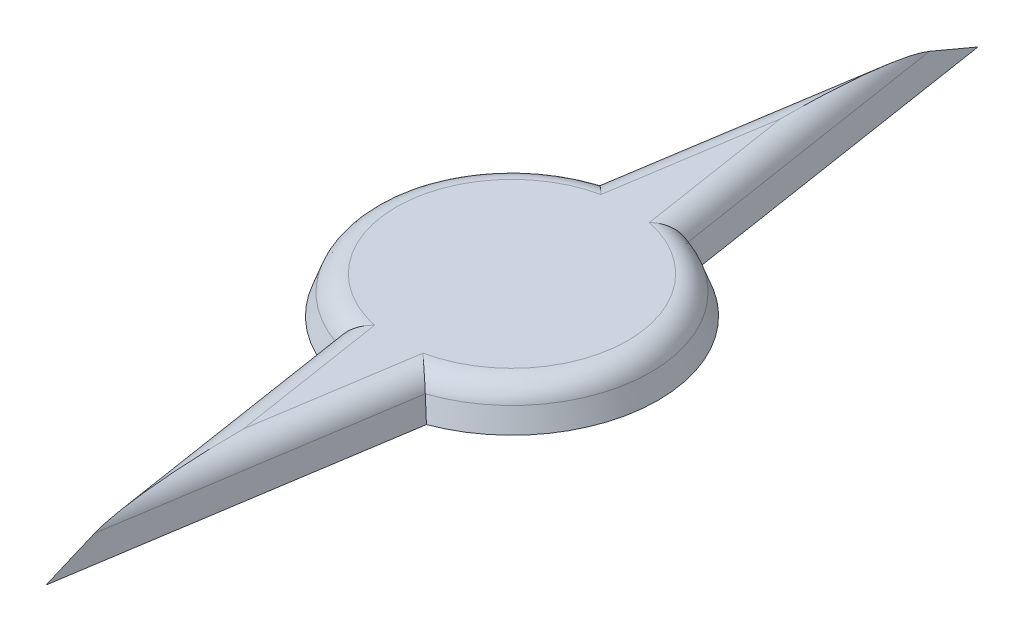
ISO-10303-21;
HEADER;
FILE_DESCRIPTION(('STEP AP214'),'2;1');
FILE_NAME('part.step','',(''),(''),'','','');
FILE_SCHEMA(('AUTOMOTIVE_DESIGN { 1 0 10303 214 1 1 1 1 }'));
ENDSEC;
DATA;
#1=APPLICATION_CONTEXT('core data for automotive mechanical design processes');
#2=APPLICATION_PROTOCOL_DEFINITION('international standard','automotive_design',2000,#1);
#3=PRODUCT_CONTEXT('',#1,'mechanical');
#4=PRODUCT('Part','Part','',(#3));
#5=PRODUCT_RELATED_PRODUCT_CATEGORY('part','',(#4));
#6=PRODUCT_DEFINITION_FORMATION('','',#4);
#7=PRODUCT_DEFINITION_CONTEXT('part definition',#1,'design');
#8=PRODUCT_DEFINITION('design','',#6,#7);
#9=PRODUCT_DEFINITION_SHAPE('','',#8);
#10=(LENGTH_UNIT() NAMED_UNIT(*) SI_UNIT(.MILLI.,.METRE.));
#11=(NAMED_UNIT(*) PLANE_ANGLE_UNIT() SI_UNIT($,.RADIAN.));
#12=(NAMED_UNIT(*) SI_UNIT($,.STERADIAN.) SOLID_ANGLE_UNIT());
#13=UNCERTAINTY_MEASURE_WITH_UNIT(LENGTH_MEASURE(1.E-05),#10,'distance_accuracy_value','');
#14=(GEOMETRIC_REPRESENTATION_CONTEXT(3) GLOBAL_UNCERTAINTY_ASSIGNED_CONTEXT((#13)) GLOBAL_UNIT_ASSIGNED_CONTEXT((#10,
#11,#12)) REPRESENTATION_CONTEXT('',''));
#15=CARTESIAN_POINT('',(0.,0.,0.));
#16=DIRECTION('',(0.,0.,1.));
#17=DIRECTION('',(1.,0.,0.));
#18=AXIS2_PLACEMENT_3D('',#15,#16,#17);
#19=CARTESIAN_POINT('',(2.90936113715403,0.,0.453006211539587));
#20=DIRECTION('',(0.928504468915029,0.342020143325669,0.14457410820859));
#21=DIRECTION('',(-0.345651567214323,0.938362933028731,0.));
#22=AXIS2_PLACEMENT_3D('',#19,#20,#21);
#23=PLANE('',#22);
#24=CARTESIAN_POINT('',(1.61628006099897,1.5,5.20905382899304));
#25=CARTESIAN_POINT('',(1.6568122500095,1.37517262260805,5.24404736233082));
#26=CARTESIAN_POINT('',(1.69739744021863,1.25029826987364,5.27881163375714));
#27=CARTESIAN_POINT('',(1.77866819175476,1.0004624570002,5.34790162958865));
#28=CARTESIAN_POINT('',(1.81935375203628,0.87550099777815,5.38222735853901));
#29=CARTESIAN_POINT('',(1.90082040335216,0.625495379312143,5.45046092932056));
#30=CARTESIAN_POINT('',(1.94160149426883,0.500451220170212,5.48436877166627));
#31=CARTESIAN_POINT('',(2.02325507800371,0.250283575520157,5.5517851050517));
#32=CARTESIAN_POINT('',(2.06412757176555,0.125160089202723,5.58529359194577));
#33=CARTESIAN_POINT('',(2.10504325451616,0.,5.61861129609611));
#34=B_SPLINE_CURVE_WITH_KNOTS('',3,(#24,#25,#26,#27,#28,#29,#30,#31,#32,#33),.UNSPECIFIED.,.F.,
.F.,(4,2,2,2,4),(0.,0.407484053916502,0.814963881129874,1.22244320659282,1.62992675837409),.UNSPECIFIED.);
#35=CARTESIAN_POINT('',(1.83026995534138,0.842020143325068,5.39132568951018));
#36=VERTEX_POINT('',#35);
#37=CARTESIAN_POINT('',(2.10504325451622,0.,5.61861129609584));
#38=VERTEX_POINT('',#37);
#39=EDGE_CURVE('E110',#36,#38,#34,.T.);
#40=ORIENTED_EDGE('',*,*,#39,.F.);
#41=DIRECTION('',(0.153852552431109,0.,-0.988093817463925));
#42=VECTOR('',#41,1.);
#43=CARTESIAN_POINT('',(0.23663372946838,0.84202014332567,15.6262036761886));
#44=LINE('',#43,#42);
#45=CARTESIAN_POINT('',(0.,0.842020143325668,17.1459465819544));
#46=VERTEX_POINT('',#45);
#47=EDGE_CURVE('E11',#36,#46,#44,.F.);
#48=ORIENTED_EDGE('',*,*,#47,.T.);
#49=DIRECTION('',(0.,0.389350510993613,-0.921089669678807));
#50=VECTOR('',#49,1.);
#51=CARTESIAN_POINT('',(0.,6.70090977149599,3.28552374977649));
#52=LINE('',#51,#50);
#53=CARTESIAN_POINT('',(0.,0.,19.1379204815121));
#54=VERTEX_POINT('',#53);
#55=EDGE_CURVE('E133',#46,#54,#52,.F.);
#56=ORIENTED_EDGE('',*,*,#55,.T.);
#57=DIRECTION('',(0.153852552431109,0.,-0.988093817463925));
#58=VECTOR('',#57,1.);
#59=CARTESIAN_POINT('',(2.90936113715403,0.,0.453006211539587));
#60=LINE('',#59,#58);
#61=EDGE_CURVE('E125',#54,#38,#60,.T.);
#62=ORIENTED_EDGE('',*,*,#61,.T.);
#63=EDGE_LOOP('',(#40,#48,#56,#62));
#64=FACE_BOUND('',#63,.T.);
#65=ADVANCED_FACE('F35',(#64),#23,.T.);
#66=CARTESIAN_POINT('',(0.,0.,0.));
#67=DIRECTION('',(0.,-1.,0.));
#68=DIRECTION('',(0.,0.,1.));
#69=AXIS2_PLACEMENT_3D('',#66,#67,#68);
#70=CONICAL_SURFACE('',#69,6.,0.349065850398867);
#71=CARTESIAN_POINT('',(1.61628006099897,1.5,-5.20905382899304));
#72=CARTESIAN_POINT('',(1.6568122500095,1.37517262260805,-5.24404736233082));
#73=CARTESIAN_POINT('',(1.69739744021863,1.25029826987364,-5.27881163375714));
#74=CARTESIAN_POINT('',(1.77866819175476,1.0004624570002,-5.34790162958865));
#75=CARTESIAN_POINT('',(1.81935375203628,0.87550099777815,-5.38222735853901));
#76=CARTESIAN_POINT('',(1.90082040335216,0.625495379312143,-5.45046092932056));
#77=CARTESIAN_POINT('',(1.94160149426883,0.500451220170212,-5.48436877166627));
#78=CARTESIAN_POINT('',(2.02325507800371,0.250283575520157,-5.5517851050517));
#79=CARTESIAN_POINT('',(2.06412757176555,0.125160089202723,-5.58529359194577));
#80=CARTESIAN_POINT('',(2.10504325451616,0.,-5.61861129609611));
#81=B_SPLINE_CURVE_WITH_KNOTS('',3,(#71,#72,#73,#74,#75,#76,#77,#78,#79,#80),.UNSPECIFIED.,.F.,
.F.,(4,2,2,2,4),(0.,0.407484053916502,0.814963881129874,1.22244320659282,1.62992675837409),.UNSPECIFIED.);
#82=CARTESIAN_POINT('',(1.83026995534138,0.842020143325065,-5.39132568951018));
#83=VERTEX_POINT('',#82);
#84=CARTESIAN_POINT('',(2.10504325451622,0.,-5.61861129609584));
#85=VERTEX_POINT('',#84);
#86=EDGE_CURVE('E119',#83,#85,#81,.T.);
#87=ORIENTED_EDGE('',*,*,#86,.F.);
#88=CARTESIAN_POINT('',(0.,0.842020143325669,0.));
#89=DIRECTION('',(0.,-1.,0.));
#90=DIRECTION('',(0.,0.,-1.));
#91=AXIS2_PLACEMENT_3D('',#88,#89,#90);
#92=CIRCLE('',#91,5.69352973117689);
#93=EDGE_CURVE('E49',#83,#36,#92,.T.);
#94=ORIENTED_EDGE('',*,*,#93,.T.);
#95=ORIENTED_EDGE('',*,*,#39,.T.);
#96=CARTESIAN_POINT('',(0.,0.,0.));
#97=DIRECTION('',(0.,1.,0.));
#98=DIRECTION('',(0.,0.,1.));
#99=AXIS2_PLACEMENT_3D('',#96,#97,#98);
#100=CIRCLE('',#99,6.);
#101=EDGE_CURVE('E113',#38,#85,#100,.T.);
#102=ORIENTED_EDGE('',*,*,#101,.T.);
#103=EDGE_LOOP('',(#87,#94,#95,#102));
#104=FACE_BOUND('',#103,.T.);
#105=ADVANCED_FACE('F112',(#104),#70,.T.);
#106=CARTESIAN_POINT('',(2.90936113715403,0.,-0.453006211539587));
#107=DIRECTION('',(0.928504468915029,0.342020143325669,-0.14457410820859));
#108=DIRECTION('',(-0.345651567214323,0.938362933028731,0.));
#109=AXIS2_PLACEMENT_3D('',#106,#107,#108);
#110=PLANE('',#109);
#111=DIRECTION('',(0.,0.389350510993613,0.921089669678807));
#112=VECTOR('',#111,1.);
#113=CARTESIAN_POINT('',(0.,6.70090977149599,-3.28552374977649));
#114=LINE('',#113,#112);
#115=CARTESIAN_POINT('',(0.,0.842020143325668,-17.1459465819544));
#116=VERTEX_POINT('',#115);
#117=CARTESIAN_POINT('',(0.,0.,-19.1379204815121));
#118=VERTEX_POINT('',#117);
#119=EDGE_CURVE('E167',#116,#118,#114,.F.);
#120=ORIENTED_EDGE('',*,*,#119,.F.);
#121=DIRECTION('',(0.153852552431109,0.,0.988093817463925));
#122=VECTOR('',#121,1.);
#123=CARTESIAN_POINT('',(2.60653975929341,0.84202014332567,-0.405854978436904));
#124=LINE('',#123,#122);
#125=EDGE_CURVE('E64',#116,#83,#124,.T.);
#126=ORIENTED_EDGE('',*,*,#125,.T.);
#127=ORIENTED_EDGE('',*,*,#86,.T.);
#128=DIRECTION('',(0.153852552431109,0.,0.988093817463925));
#129=VECTOR('',#128,1.);
#130=CARTESIAN_POINT('',(2.90936113715403,0.,-0.453006211539587));
#131=LINE('',#130,#129);
#132=EDGE_CURVE('E129',#118,#85,#131,.T.);
#133=ORIENTED_EDGE('',*,*,#132,.F.);
#134=EDGE_LOOP('',(#120,#126,#127,#133));
#135=FACE_BOUND('',#134,.T.);
#136=ADVANCED_FACE('F155',(#135),#110,.T.);
#137=CARTESIAN_POINT('',(-2.90936113715403,0.,-0.453006211539587));
#138=DIRECTION('',(-0.928504468915029,0.342020143325669,-0.14457410820859));
#139=DIRECTION('',(-0.345651567214323,-0.938362933028731,0.));
#140=AXIS2_PLACEMENT_3D('',#137,#138,#139);
#141=PLANE('',#140);
#142=CARTESIAN_POINT('',(-1.61628006099897,1.5,-5.20905382899304));
#143=CARTESIAN_POINT('',(-1.6568122500095,1.37517262260805,-5.24404736233082));
#144=CARTESIAN_POINT('',(-1.69739744021863,1.25029826987364,-5.27881163375714));
#145=CARTESIAN_POINT('',(-1.77866819175476,1.0004624570002,-5.34790162958865));
#146=CARTESIAN_POINT('',(-1.81935375203628,0.87550099777815,-5.38222735853901));
#147=CARTESIAN_POINT('',(-1.90082040335216,0.625495379312143,-5.45046092932056));
#148=CARTESIAN_POINT('',(-1.94160149426883,0.500451220170212,-5.48436877166627));
#149=CARTESIAN_POINT('',(-2.02325507800371,0.250283575520157,-5.5517851050517));
#150=CARTESIAN_POINT('',(-2.06412757176555,0.125160089202723,-5.58529359194577));
#151=CARTESIAN_POINT('',(-2.10504325451616,0.,-5.61861129609611));
#152=B_SPLINE_CURVE_WITH_KNOTS('',3,(#142,#143,#144,#145,#146,#147,#148,#149,#150,#151),
.UNSPECIFIED.,.F.,.F.,(4,2,2,2,4),(0.,0.407484053916502,0.814963881129874,1.22244320659282,
1.62992675837409),.UNSPECIFIED.);
#153=CARTESIAN_POINT('',(-1.83026995534138,0.842020143325068,-5.39132568951018));
#154=VERTEX_POINT('',#153);
#155=CARTESIAN_POINT('',(-2.10504325451622,0.,-5.61861129609584));
#156=VERTEX_POINT('',#155);
#157=EDGE_CURVE('E355',#154,#156,#152,.T.);
#158=ORIENTED_EDGE('',*,*,#157,.F.);
#159=DIRECTION('',(-0.153852552431109,0.,0.988093817463925));
#160=VECTOR('',#159,1.);
#161=CARTESIAN_POINT('',(-0.23663372946838,0.84202014332567,-15.6262036761886));
#162=LINE('',#161,#160);
#163=EDGE_CURVE('E352',#154,#116,#162,.F.);
#164=ORIENTED_EDGE('',*,*,#163,.T.);
#165=ORIENTED_EDGE('',*,*,#119,.T.);
#166=DIRECTION('',(-0.153852552431109,0.,0.988093817463925));
#167=VECTOR('',#166,1.);
#168=CARTESIAN_POINT('',(-2.90936113715403,0.,-0.453006211539587));
#169=LINE('',#168,#167);
#170=EDGE_CURVE('E139',#118,#156,#169,.T.);
#171=ORIENTED_EDGE('',*,*,#170,.T.);
#172=EDGE_LOOP('',(#158,#164,#165,#171));
#173=FACE_BOUND('',#172,.T.);
#174=ADVANCED_FACE('F174',(#173),#141,.T.);
#175=CARTESIAN_POINT('',(0.,0.,0.));
#176=DIRECTION('',(0.,-1.,0.));
#177=DIRECTION('',(0.,0.,1.));
#178=AXIS2_PLACEMENT_3D('',#175,#176,#177);
#179=CONICAL_SURFACE('',#178,6.,0.349065850398867);
#180=CARTESIAN_POINT('',(-1.61628006099897,1.5,5.20905382899304));
#181=CARTESIAN_POINT('',(-1.6568122500095,1.37517262260805,5.24404736233082));
#182=CARTESIAN_POINT('',(-1.69739744021863,1.25029826987364,5.27881163375714));
#183=CARTESIAN_POINT('',(-1.77866819175476,1.0004624570002,5.34790162958865));
#184=CARTESIAN_POINT('',(-1.81935375203628,0.87550099777815,5.38222735853901));
#185=CARTESIAN_POINT('',(-1.90082040335216,0.625495379312143,5.45046092932056));
#186=CARTESIAN_POINT('',(-1.94160149426883,0.500451220170212,5.48436877166627));
#187=CARTESIAN_POINT('',(-2.02325507800371,0.250283575520157,5.5517851050517));
#188=CARTESIAN_POINT('',(-2.06412757176555,0.125160089202723,5.58529359194577));
#189=CARTESIAN_POINT('',(-2.10504325451616,0.,5.61861129609611));
#190=B_SPLINE_CURVE_WITH_KNOTS('',3,(#180,#181,#182,#183,#184,#185,#186,#187,#188,#189),
.UNSPECIFIED.,.F.,.F.,(4,2,2,2,4),(0.,0.407484053916502,0.814963881129874,1.22244320659282,
1.62992675837409),.UNSPECIFIED.);
#191=CARTESIAN_POINT('',(-1.83026995534138,0.842020143325065,5.39132568951018));
#192=VERTEX_POINT('',#191);
#193=CARTESIAN_POINT('',(-2.10504325451622,0.,5.61861129609584));
#194=VERTEX_POINT('',#193);
#195=EDGE_CURVE('E356',#192,#194,#190,.T.);
#196=ORIENTED_EDGE('',*,*,#195,.F.);
#197=CARTESIAN_POINT('',(0.,0.842020143325669,0.));
#198=DIRECTION('',(0.,-1.,0.));
#199=DIRECTION('',(0.,0.,-1.));
#200=AXIS2_PLACEMENT_3D('',#197,#198,#199);
#201=CIRCLE('',#200,5.69352973117689);
#202=EDGE_CURVE('E350',#192,#154,#201,.T.);
#203=ORIENTED_EDGE('',*,*,#202,.T.);
#204=ORIENTED_EDGE('',*,*,#157,.T.);
#205=EDGE_CURVE('E131',#156,#194,#100,.T.);
#206=ORIENTED_EDGE('',*,*,#205,.T.);
#207=EDGE_LOOP('',(#196,#203,#204,#206));
#208=FACE_BOUND('',#207,.T.);
#209=ADVANCED_FACE('F239',(#208),#179,.T.);
#210=CARTESIAN_POINT('',(-2.90936113715403,0.,0.453006211539587));
#211=DIRECTION('',(-0.928504468915029,0.342020143325669,0.14457410820859));
#212=DIRECTION('',(-0.345651567214323,-0.938362933028731,0.));
#213=AXIS2_PLACEMENT_3D('',#210,#211,#212);
#214=PLANE('',#213);
#215=ORIENTED_EDGE('',*,*,#55,.F.);
#216=DIRECTION('',(-0.153852552431109,0.,-0.988093817463925));
#217=VECTOR('',#216,1.);
#218=CARTESIAN_POINT('',(-2.60653975929341,0.84202014332567,0.405854978436904));
#219=LINE('',#218,#217);
#220=EDGE_CURVE('E118',#46,#192,#219,.T.);
#221=ORIENTED_EDGE('',*,*,#220,.T.);
#222=ORIENTED_EDGE('',*,*,#195,.T.);
#223=DIRECTION('',(-0.153852552431109,0.,-0.988093817463925));
#224=VECTOR('',#223,1.);
#225=CARTESIAN_POINT('',(-2.90936113715403,0.,0.453006211539587));
#226=LINE('',#225,#224);
#227=EDGE_CURVE('E142',#54,#194,#226,.T.);
#228=ORIENTED_EDGE('',*,*,#227,.F.);
#229=EDGE_LOOP('',(#215,#221,#222,#228));
#230=FACE_BOUND('',#229,.T.);
#231=ADVANCED_FACE('F156',(#230),#214,.T.);
#232=CARTESIAN_POINT('',(0.,1.5,0.));
#233=DIRECTION('',(0.,1.,0.));
#234=DIRECTION('',(0.,0.,1.));
#235=AXIS2_PLACEMENT_3D('',#232,#233,#234);
#236=PLANE('',#235);
#237=CARTESIAN_POINT('',(0.,1.5,0.));
#238=DIRECTION('',(0.,1.,0.));
#239=DIRECTION('',(0.,0.,1.));
#240=AXIS2_PLACEMENT_3D('',#237,#238,#239);
#241=CIRCLE('',#240,4.75383711039099);
#242=CARTESIAN_POINT('',(-0.994907483990374,1.5,-4.64856175288986));
#243=VERTEX_POINT('',#242);
#244=CARTESIAN_POINT('',(-0.994907483990373,1.5,4.64856175288986));
#245=VERTEX_POINT('',#244);
#246=EDGE_CURVE('E340',#243,#245,#241,.T.);
#247=ORIENTED_EDGE('',*,*,#246,.T.);
#248=DIRECTION('',(-0.153852552431109,0.,-0.988093817463925));
#249=VECTOR('',#248,1.);
#250=CARTESIAN_POINT('',(-1.67803529037839,1.5,0.261280870228314));
#251=LINE('',#250,#249);
#252=CARTESIAN_POINT('',(0.,1.5,11.0381985729853));
#253=VERTEX_POINT('',#252);
#254=EDGE_CURVE('E342',#245,#253,#251,.F.);
#255=ORIENTED_EDGE('',*,*,#254,.T.);
#256=DIRECTION('',(-0.153852552431109,0.,0.988093817463925));
#257=VECTOR('',#256,1.);
#258=CARTESIAN_POINT('',(0.924409321552325,1.5,5.10132511200797));
#259=LINE('',#258,#257);
#260=CARTESIAN_POINT('',(0.994907483990374,1.5,4.64856175288986));
#261=VERTEX_POINT('',#260);
#262=EDGE_CURVE('E376',#253,#261,#259,.F.);
#263=ORIENTED_EDGE('',*,*,#262,.T.);
#264=CARTESIAN_POINT('',(0.,1.5,0.));
#265=DIRECTION('',(0.,1.,0.));
#266=DIRECTION('',(0.,0.,1.));
#267=AXIS2_PLACEMENT_3D('',#264,#265,#266);
#268=CIRCLE('',#267,4.75383711039099);
#269=CARTESIAN_POINT('',(0.994907483990373,1.5,-4.64856175288986));
#270=VERTEX_POINT('',#269);
#271=EDGE_CURVE('E344',#261,#270,#268,.T.);
#272=ORIENTED_EDGE('',*,*,#271,.T.);
#273=DIRECTION('',(0.153852552431109,0.,0.988093817463925));
#274=VECTOR('',#273,1.);
#275=CARTESIAN_POINT('',(1.67803529037839,1.5,-0.261280870228314));
#276=LINE('',#275,#274);
#277=CARTESIAN_POINT('',(0.,1.5,-11.0381985729853));
#278=VERTEX_POINT('',#277);
#279=EDGE_CURVE('E335',#270,#278,#276,.F.);
#280=ORIENTED_EDGE('',*,*,#279,.T.);
#281=DIRECTION('',(0.153852552431109,0.,-0.988093817463925));
#282=VECTOR('',#281,1.);
#283=CARTESIAN_POINT('',(-0.924409321552325,1.5,-5.10132511200797));
#284=LINE('',#283,#282);
#285=EDGE_CURVE('E338',#278,#243,#284,.F.);
#286=ORIENTED_EDGE('',*,*,#285,.T.);
#287=EDGE_LOOP('',(#247,#255,#263,#272,#280,#286));
#288=FACE_BOUND('',#287,.T.);
#289=ADVANCED_FACE('F252',(#288),#236,.T.);
#290=CARTESIAN_POINT('',(0.,0.,0.));
#291=DIRECTION('',(0.,1.,0.));
#292=DIRECTION('',(0.,0.,1.));
#293=AXIS2_PLACEMENT_3D('',#290,#291,#292);
#294=PLANE('',#293);
#295=ORIENTED_EDGE('',*,*,#61,.F.);
#296=ORIENTED_EDGE('',*,*,#227,.T.);
#297=ORIENTED_EDGE('',*,*,#205,.F.);
#298=ORIENTED_EDGE('',*,*,#170,.F.);
#299=ORIENTED_EDGE('',*,*,#132,.T.);
#300=ORIENTED_EDGE('',*,*,#101,.F.);
#301=EDGE_LOOP('',(#295,#296,#297,#298,#299,#300));
#302=FACE_BOUND('',#301,.T.);
#303=ADVANCED_FACE('F123',(#302),#294,.F.);
#304=CARTESIAN_POINT('',(1.67803529037838,0.5,-0.261280870228314));
#305=DIRECTION('',(0.153852552431109,0.,0.988093817463925));
#306=DIRECTION('',(0.988093817463925,0.,-0.153852552431109));
#307=AXIS2_PLACEMENT_3D('',#304,#305,#306);
#308=CYLINDRICAL_SURFACE('',#307,1.);
#309=CARTESIAN_POINT('',(0.,0.5,-11.0381985729853));
#310=DIRECTION('',(1.,0.,0.));
#311=DIRECTION('',(0.,0.,1.));
#312=AXIS2_PLACEMENT_3D('',#309,#310,#311);
#313=ELLIPSE('',#312,6.49972967102887,1.);
#314=EDGE_CURVE('E136',#278,#116,#313,.F.);
#315=ORIENTED_EDGE('',*,*,#314,.F.);
#316=ORIENTED_EDGE('',*,*,#279,.F.);
#317=CARTESIAN_POINT('',(1.8302699553424,0.84202014332567,-5.39132568951153));
#318=CARTESIAN_POINT('',(1.82178981353742,0.868059089311883,-5.38419726372572));
#319=CARTESIAN_POINT('',(1.81238638421831,0.893559840203512,-5.37628237909534));
#320=CARTESIAN_POINT('',(1.7918756416508,0.943324370294564,-5.35898293396907));
#321=CARTESIAN_POINT('',(1.78076966774971,0.967589102019278,-5.34959952859988));
#322=CARTESIAN_POINT('',(1.74524830764782,1.03803365233617,-5.31951703617427));
#323=CARTESIAN_POINT('',(1.71851252752537,1.08221506298783,-5.29678780059815));
#324=CARTESIAN_POINT('',(1.66021001289462,1.16413957633613,-5.2469199172914));
#325=CARTESIAN_POINT('',(1.62865732549502,1.20190074596514,-5.21979407722628));
#326=CARTESIAN_POINT('',(1.56178392545022,1.27080503328503,-5.16190004124216));
#327=CARTESIAN_POINT('',(1.52645739053703,1.30193769648755,-5.13112620896427));
#328=CARTESIAN_POINT('',(1.44904624431465,1.36044681598081,-5.06316282748129));
#329=CARTESIAN_POINT('',(1.40664730777196,1.38701729180475,-5.02564051859422));
#330=CARTESIAN_POINT('',(1.31980977865453,1.43172870090486,-4.94805171821582));
#331=CARTESIAN_POINT('',(1.27537090118049,1.44986845278176,-4.90798487105136));
#332=CARTESIAN_POINT('',(1.19230364677369,1.47576897634037,-4.8323171338724));
#333=CARTESIAN_POINT('',(1.15380900268529,1.48468199261312,-4.79695330895735));
#334=CARTESIAN_POINT('',(1.07669906596949,1.49666843758397,-4.72546416433867));
#335=CARTESIAN_POINT('',(1.03808404034852,1.49975059134193,-4.68934006431663));
#336=CARTESIAN_POINT('',(0.99807839663748,1.49999516031506,-4.65155817007983));
#337=CARTESIAN_POINT('',(0.996492763874704,1.50000000401357,-4.65006008913247));
#338=CARTESIAN_POINT('',(0.994907483990374,1.5,-4.64856175288986));
#339=B_SPLINE_CURVE_WITH_KNOTS('',3,(#317,#318,#319,#320,#321,#322,#323,#324,#325,#326,#327,
#328,#329,#330,#331,#332,#333,#334,#335,#336,#337,#338),.UNSPECIFIED.,.F.,.F.,(4,2,2,2,2,2,2,2,
2,2,4),(0.,0.0848254181780801,0.169584445641453,0.337970120457949,0.505873810494479,
0.674040388237911,0.860959336635322,1.04790447013604,1.20667335861085,1.36520448343832,
1.37174865376917),.UNSPECIFIED.);
#340=EDGE_CURVE('E40',#83,#270,#339,.T.);
#341=ORIENTED_EDGE('',*,*,#340,.F.);
#342=ORIENTED_EDGE('',*,*,#125,.F.);
#343=EDGE_LOOP('',(#315,#316,#341,#342));
#344=FACE_BOUND('',#343,.T.);
#345=ADVANCED_FACE('F37',(#344),#308,.T.);
#346=CARTESIAN_POINT('',(0.,0.5,0.));
#347=DIRECTION('',(0.,1.,0.));
#348=DIRECTION('',(0.,0.,1.));
#349=AXIS2_PLACEMENT_3D('',#346,#347,#348);
#350=TOROIDAL_SURFACE('',#349,4.75383711039099,1.);
#351=ORIENTED_EDGE('',*,*,#340,.T.);
#352=ORIENTED_EDGE('',*,*,#271,.F.);
#353=CARTESIAN_POINT('',(1.83026995534289,0.84202014332567,5.39132568951095));
#354=CARTESIAN_POINT('',(1.8217898135376,0.868059089311882,5.3841972637255));
#355=CARTESIAN_POINT('',(1.81238638421836,0.89355984020351,5.37628237909529));
#356=CARTESIAN_POINT('',(1.79187564165076,0.943324370294559,5.35898293396913));
#357=CARTESIAN_POINT('',(1.7807696677497,0.967589102019272,5.3495995285999));
#358=CARTESIAN_POINT('',(1.74524830764786,1.03803365233616,5.31951703617423));
#359=CARTESIAN_POINT('',(1.71851252752539,1.08221506298782,5.29678780059815));
#360=CARTESIAN_POINT('',(1.66021001289463,1.16413957633611,5.24691991729142));
#361=CARTESIAN_POINT('',(1.62865732549503,1.20190074596513,5.2197940772263));
#362=CARTESIAN_POINT('',(1.56178392545024,1.27080503328502,5.16190004124217));
#363=CARTESIAN_POINT('',(1.52645739053705,1.30193769648754,5.13112620896429));
#364=CARTESIAN_POINT('',(1.44904624431468,1.36044681598079,5.06316282748131));
#365=CARTESIAN_POINT('',(1.40664730777199,1.38701729180473,5.02564051859424));
#366=CARTESIAN_POINT('',(1.31980977865455,1.43172870090484,4.94805171821584));
#367=CARTESIAN_POINT('',(1.27537090118052,1.44986845278175,4.90798487105139));
#368=CARTESIAN_POINT('',(1.19230364677371,1.47576897634036,4.83231713387242));
#369=CARTESIAN_POINT('',(1.15380900268531,1.48468199261311,4.79695330895737));
#370=CARTESIAN_POINT('',(1.0766990659695,1.49666843758397,4.72546416433868));
#371=CARTESIAN_POINT('',(1.03808404034852,1.49975059134194,4.68934006431663));
#372=CARTESIAN_POINT('',(0.998078396637479,1.49999516031506,4.65155817007983));
#373=CARTESIAN_POINT('',(0.996492763874704,1.50000000401357,4.65006008913247));
#374=CARTESIAN_POINT('',(0.994907483990374,1.5,4.64856175288986));
#375=B_SPLINE_CURVE_WITH_KNOTS('',3,(#353,#354,#355,#356,#357,#358,#359,#360,#361,#362,#363,
#364,#365,#366,#367,#368,#369,#370,#371,#372,#373,#374),.UNSPECIFIED.,.F.,.F.,(4,2,2,2,2,2,2,2,
2,2,4),(0.,0.0848254181780758,0.169584445641444,0.33797012045793,0.505873810494454,
0.674040388237876,0.860959336635284,1.047904470136,1.20667335861083,1.36520448343832,
1.37174865376917),.UNSPECIFIED.);
#376=EDGE_CURVE('E199',#36,#261,#375,.T.);
#377=ORIENTED_EDGE('',*,*,#376,.F.);
#378=ORIENTED_EDGE('',*,*,#93,.F.);
#379=EDGE_LOOP('',(#351,#352,#377,#378));
#380=FACE_BOUND('',#379,.T.);
#381=ADVANCED_FACE('F207',(#380),#350,.T.);
#382=CARTESIAN_POINT('',(-1.67803529037838,0.5,-0.261280870228314));
#383=DIRECTION('',(-0.153852552431109,0.,0.988093817463925));
#384=DIRECTION('',(0.988093817463925,0.,0.153852552431109));
#385=AXIS2_PLACEMENT_3D('',#382,#383,#384);
#386=CYLINDRICAL_SURFACE('',#385,1.);
#387=ORIENTED_EDGE('',*,*,#314,.T.);
#388=ORIENTED_EDGE('',*,*,#163,.F.);
#389=CARTESIAN_POINT('',(-1.83026995534289,0.84202014332567,-5.39132568951095));
#390=CARTESIAN_POINT('',(-1.8217898135376,0.868059089311882,-5.3841972637255));
#391=CARTESIAN_POINT('',(-1.81238638421836,0.89355984020351,-5.37628237909529));
#392=CARTESIAN_POINT('',(-1.79187564165076,0.94332437029456,-5.35898293396913));
#393=CARTESIAN_POINT('',(-1.7807696677497,0.967589102019272,-5.3495995285999));
#394=CARTESIAN_POINT('',(-1.74524830764786,1.03803365233616,-5.31951703617423));
#395=CARTESIAN_POINT('',(-1.71851252752539,1.08221506298782,-5.29678780059815));
#396=CARTESIAN_POINT('',(-1.66021001289463,1.16413957633611,-5.24691991729142));
#397=CARTESIAN_POINT('',(-1.62865732549503,1.20190074596513,-5.2197940772263));
#398=CARTESIAN_POINT('',(-1.56178392545024,1.27080503328502,-5.16190004124217));
#399=CARTESIAN_POINT('',(-1.52645739053705,1.30193769648754,-5.13112620896429));
#400=CARTESIAN_POINT('',(-1.44904624431468,1.36044681598079,-5.06316282748131));
#401=CARTESIAN_POINT('',(-1.40664730777199,1.38701729180473,-5.02564051859424));
#402=CARTESIAN_POINT('',(-1.31980977865455,1.43172870090484,-4.94805171821584));
#403=CARTESIAN_POINT('',(-1.27537090118052,1.44986845278175,-4.90798487105139));
#404=CARTESIAN_POINT('',(-1.19230364677371,1.47576897634036,-4.83231713387242));
#405=CARTESIAN_POINT('',(-1.15380900268531,1.48468199261311,-4.79695330895736));
#406=CARTESIAN_POINT('',(-1.0766990659695,1.49666843758397,-4.72546416433869));
#407=CARTESIAN_POINT('',(-1.0380840403485,1.49975059134194,-4.68934006431665));
#408=CARTESIAN_POINT('',(-0.998078396637478,1.49999516031506,-4.65155817007983));
#409=CARTESIAN_POINT('',(-0.996492763874703,1.50000000401357,-4.65006008913247));
#410=CARTESIAN_POINT('',(-0.994907483990374,1.5,-4.64856175288986));
#411=B_SPLINE_CURVE_WITH_KNOTS('',3,(#389,#390,#391,#392,#393,#394,#395,#396,#397,#398,#399,
#400,#401,#402,#403,#404,#405,#406,#407,#408,#409,#410),.UNSPECIFIED.,.F.,.F.,(4,2,2,2,2,2,2,2,
2,2,4),(0.,0.0848254181780764,0.169584445641445,0.337970120457931,0.505873810494453,
0.674040388237876,0.860959336635284,1.047904470136,1.20667335861083,1.36520448343832,
1.37174865376917),.UNSPECIFIED.);
#412=EDGE_CURVE('E193',#243,#154,#411,.F.);
#413=ORIENTED_EDGE('',*,*,#412,.F.);
#414=ORIENTED_EDGE('',*,*,#285,.F.);
#415=EDGE_LOOP('',(#387,#388,#413,#414));
#416=FACE_BOUND('',#415,.T.);
#417=ADVANCED_FACE('F203',(#416),#386,.T.);
#418=CARTESIAN_POINT('',(1.67803529037838,0.5,0.261280870228314));
#419=DIRECTION('',(0.153852552431109,0.,-0.988093817463925));
#420=DIRECTION('',(-0.988093817463925,0.,-0.153852552431109));
#421=AXIS2_PLACEMENT_3D('',#418,#419,#420);
#422=CYLINDRICAL_SURFACE('',#421,1.);
#423=ORIENTED_EDGE('',*,*,#376,.T.);
#424=ORIENTED_EDGE('',*,*,#262,.F.);
#425=CARTESIAN_POINT('',(0.,0.5,11.0381985729853));
#426=DIRECTION('',(1.,0.,0.));
#427=DIRECTION('',(0.,0.,-1.));
#428=AXIS2_PLACEMENT_3D('',#425,#426,#427);
#429=ELLIPSE('',#428,6.49972967102887,1.);
#430=EDGE_CURVE('E190',#46,#253,#429,.F.);
#431=ORIENTED_EDGE('',*,*,#430,.F.);
#432=ORIENTED_EDGE('',*,*,#47,.F.);
#433=EDGE_LOOP('',(#423,#424,#431,#432));
#434=FACE_BOUND('',#433,.T.);
#435=ADVANCED_FACE('F206',(#434),#422,.T.);
#436=CARTESIAN_POINT('',(0.,0.5,0.));
#437=DIRECTION('',(0.,1.,0.));
#438=DIRECTION('',(0.,0.,1.));
#439=AXIS2_PLACEMENT_3D('',#436,#437,#438);
#440=TOROIDAL_SURFACE('',#439,4.75383711039099,1.);
#441=ORIENTED_EDGE('',*,*,#412,.T.);
#442=ORIENTED_EDGE('',*,*,#202,.F.);
#443=CARTESIAN_POINT('',(-1.8302699553424,0.84202014332567,5.39132568951153));
#444=CARTESIAN_POINT('',(-1.82178981353742,0.868059089311883,5.38419726372572));
#445=CARTESIAN_POINT('',(-1.81238638421831,0.893559840203512,5.37628237909534));
#446=CARTESIAN_POINT('',(-1.7918756416508,0.943324370294564,5.35898293396907));
#447=CARTESIAN_POINT('',(-1.78076966774971,0.967589102019278,5.34959952859988));
#448=CARTESIAN_POINT('',(-1.74524830764782,1.03803365233617,5.31951703617427));
#449=CARTESIAN_POINT('',(-1.71851252752537,1.08221506298783,5.29678780059815));
#450=CARTESIAN_POINT('',(-1.66021001289462,1.16413957633613,5.2469199172914));
#451=CARTESIAN_POINT('',(-1.62865732549502,1.20190074596514,5.21979407722628));
#452=CARTESIAN_POINT('',(-1.56178392545022,1.27080503328503,5.16190004124216));
#453=CARTESIAN_POINT('',(-1.52645739053703,1.30193769648755,5.13112620896427));
#454=CARTESIAN_POINT('',(-1.44904624431465,1.36044681598081,5.06316282748129));
#455=CARTESIAN_POINT('',(-1.40664730777196,1.38701729180475,5.02564051859422));
#456=CARTESIAN_POINT('',(-1.31980977865453,1.43172870090486,4.94805171821582));
#457=CARTESIAN_POINT('',(-1.27537090118049,1.44986845278176,4.90798487105136));
#458=CARTESIAN_POINT('',(-1.19230364677369,1.47576897634037,4.8323171338724));
#459=CARTESIAN_POINT('',(-1.15380900268529,1.48468199261312,4.79695330895735));
#460=CARTESIAN_POINT('',(-1.07669906596949,1.49666843758397,4.72546416433867));
#461=CARTESIAN_POINT('',(-1.03808404034852,1.49975059134193,4.68934006431663));
#462=CARTESIAN_POINT('',(-0.99807839663748,1.49999516031506,4.65155817007983));
#463=CARTESIAN_POINT('',(-0.996492763874704,1.50000000401357,4.65006008913247));
#464=CARTESIAN_POINT('',(-0.994907483990374,1.5,4.64856175288986));
#465=B_SPLINE_CURVE_WITH_KNOTS('',3,(#443,#444,#445,#446,#447,#448,#449,#450,#451,#452,#453,
#454,#455,#456,#457,#458,#459,#460,#461,#462,#463,#464),.UNSPECIFIED.,.F.,.F.,(4,2,2,2,2,2,2,2,
2,2,4),(0.,0.0848254181780801,0.169584445641453,0.337970120457949,0.505873810494479,
0.674040388237911,0.860959336635322,1.04790447013604,1.20667335861085,1.36520448343832,
1.37174865376917),.UNSPECIFIED.);
#466=EDGE_CURVE('E185',#245,#192,#465,.F.);
#467=ORIENTED_EDGE('',*,*,#466,.F.);
#468=ORIENTED_EDGE('',*,*,#246,.F.);
#469=EDGE_LOOP('',(#441,#442,#467,#468));
#470=FACE_BOUND('',#469,.T.);
#471=ADVANCED_FACE('F180',(#470),#440,.T.);
#472=CARTESIAN_POINT('',(-1.67803529037838,0.5,0.261280870228314));
#473=DIRECTION('',(-0.153852552431109,0.,-0.988093817463925));
#474=DIRECTION('',(-0.988093817463925,0.,0.153852552431109));
#475=AXIS2_PLACEMENT_3D('',#472,#473,#474);
#476=CYLINDRICAL_SURFACE('',#475,1.);
#477=ORIENTED_EDGE('',*,*,#430,.T.);
#478=ORIENTED_EDGE('',*,*,#254,.F.);
#479=ORIENTED_EDGE('',*,*,#466,.T.);
#480=ORIENTED_EDGE('',*,*,#220,.F.);
#481=EDGE_LOOP('',(#477,#478,#479,#480));
#482=FACE_BOUND('',#481,.T.);
#483=ADVANCED_FACE('F176',(#482),#476,.T.);
#484=CLOSED_SHELL('',(#65,#105,#136,#174,#209,#231,#289,#303,#345,#381,#417,#435,#471,#483));
#485=MANIFOLD_SOLID_BREP('B2',#484);
#486=ADVANCED_BREP_SHAPE_REPRESENTATION('',(#18,#485),#14);
#487=SHAPE_DEFINITION_REPRESENTATION(#9,#486);
ENDSEC;
END-ISO-10303-21;
